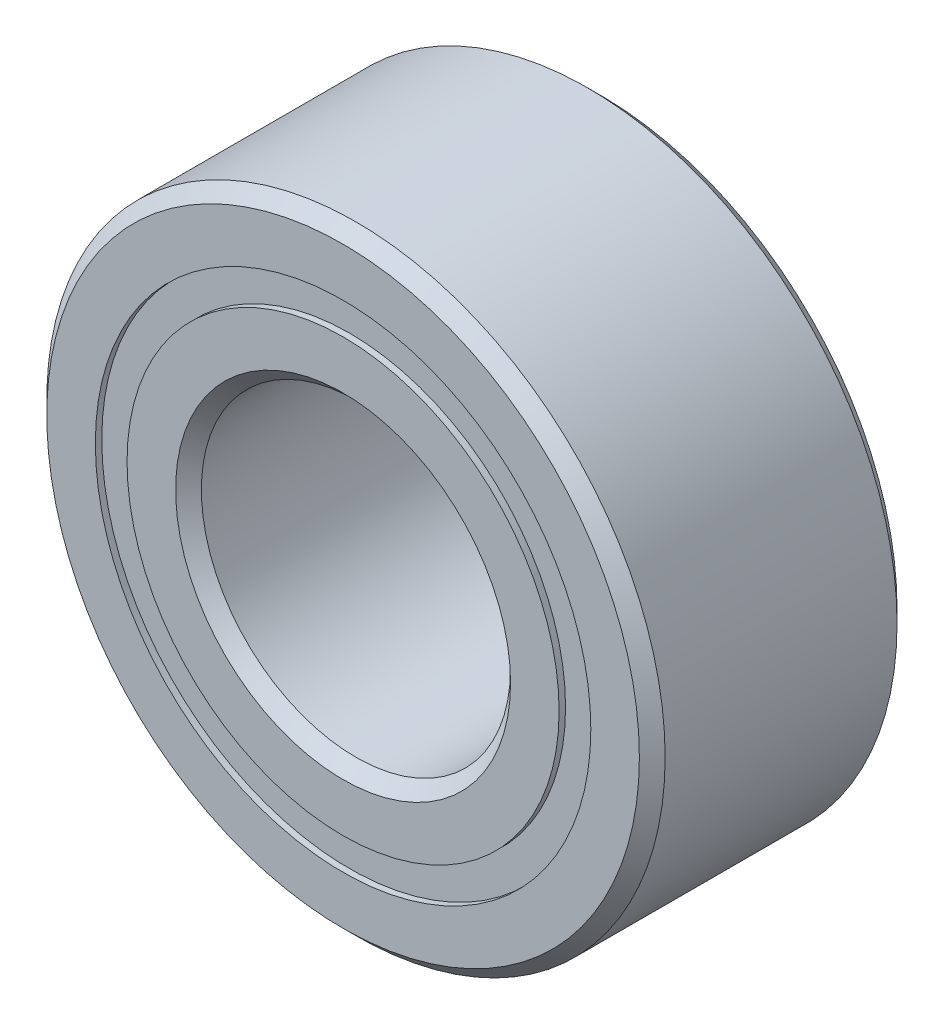
ISO-10303-21;
HEADER;
FILE_DESCRIPTION(('STEP AP214'),'2;1');
FILE_NAME('part.step','',(''),(''),'','','');
FILE_SCHEMA(('AUTOMOTIVE_DESIGN { 1 0 10303 214 1 1 1 1 }'));
ENDSEC;
DATA;
#1=APPLICATION_CONTEXT('core data for automotive mechanical design processes');
#2=APPLICATION_PROTOCOL_DEFINITION('international standard','automotive_design',2000,#1);
#3=PRODUCT_CONTEXT('',#1,'mechanical');
#4=PRODUCT('Part','Part','',(#3));
#5=PRODUCT_RELATED_PRODUCT_CATEGORY('part','',(#4));
#6=PRODUCT_DEFINITION_FORMATION('','',#4);
#7=PRODUCT_DEFINITION_CONTEXT('part definition',#1,'design');
#8=PRODUCT_DEFINITION('design','',#6,#7);
#9=PRODUCT_DEFINITION_SHAPE('','',#8);
#10=(LENGTH_UNIT() NAMED_UNIT(*) SI_UNIT(.MILLI.,.METRE.));
#11=(NAMED_UNIT(*) PLANE_ANGLE_UNIT() SI_UNIT($,.RADIAN.));
#12=(NAMED_UNIT(*) SI_UNIT($,.STERADIAN.) SOLID_ANGLE_UNIT());
#13=UNCERTAINTY_MEASURE_WITH_UNIT(LENGTH_MEASURE(1.E-05),#10,'distance_accuracy_value','');
#14=(GEOMETRIC_REPRESENTATION_CONTEXT(3) GLOBAL_UNCERTAINTY_ASSIGNED_CONTEXT((#13)) GLOBAL_UNIT_ASSIGNED_CONTEXT((#10,
#11,#12)) REPRESENTATION_CONTEXT('',''));
#15=CARTESIAN_POINT('',(0.,0.,0.));
#16=DIRECTION('',(0.,0.,1.));
#17=DIRECTION('',(1.,0.,0.));
#18=AXIS2_PLACEMENT_3D('',#15,#16,#17);
#19=CARTESIAN_POINT('',(0.,2.40384615384615,-1.1875));
#20=DIRECTION('',(0.,0.,1.));
#21=DIRECTION('',(1.,0.,0.));
#22=AXIS2_PLACEMENT_3D('',#19,#20,#21);
#23=PLANE('',#22);
#24=CARTESIAN_POINT('',(0.,0.,-1.1875));
#25=DIRECTION('',(0.,0.,1.));
#26=DIRECTION('',(1.,0.,0.));
#27=AXIS2_PLACEMENT_3D('',#24,#25,#26);
#28=CIRCLE('',#27,2.40384615384615);
#29=CARTESIAN_POINT('',(2.40384615384615,0.,-1.1875));
#30=VERTEX_POINT('',#29);
#31=EDGE_CURVE('E55',#30,#30,#28,.T.);
#32=ORIENTED_EDGE('',*,*,#31,.F.);
#33=EDGE_LOOP('',(#32));
#34=FACE_BOUND('',#33,.T.);
#35=CARTESIAN_POINT('',(0.,0.,-1.1875));
#36=DIRECTION('',(0.,0.,1.));
#37=DIRECTION('',(1.,0.,0.));
#38=AXIS2_PLACEMENT_3D('',#35,#36,#37);
#39=CIRCLE('',#38,2.09615384615385);
#40=CARTESIAN_POINT('',(2.09615384615385,0.,-1.1875));
#41=VERTEX_POINT('',#40);
#42=EDGE_CURVE('E11',#41,#41,#39,.T.);
#43=ORIENTED_EDGE('',*,*,#42,.T.);
#44=EDGE_LOOP('',(#43));
#45=FACE_BOUND('',#44,.T.);
#46=ADVANCED_FACE('F41',(#34,#45),#23,.F.);
#47=CARTESIAN_POINT('',(0.,0.,1.25));
#48=DIRECTION('',(0.,0.,1.));
#49=DIRECTION('',(1.,0.,0.));
#50=AXIS2_PLACEMENT_3D('',#47,#48,#49);
#51=CYLINDRICAL_SURFACE('',#50,2.09615384615385);
#52=ORIENTED_EDGE('',*,*,#42,.F.);
#53=EDGE_LOOP('',(#52));
#54=FACE_BOUND('',#53,.T.);
#55=CARTESIAN_POINT('',(0.,0.,-0.576463888168111));
#56=DIRECTION('',(0.,0.,1.));
#57=DIRECTION('',(1.,0.,0.));
#58=AXIS2_PLACEMENT_3D('',#55,#56,#57);
#59=CIRCLE('',#58,2.09615384615385);
#60=CARTESIAN_POINT('',(2.09615384615385,0.,-0.576463888168111));
#61=VERTEX_POINT('',#60);
#62=EDGE_CURVE('E47',#61,#61,#59,.T.);
#63=ORIENTED_EDGE('',*,*,#62,.T.);
#64=EDGE_LOOP('',(#63));
#65=FACE_BOUND('',#64,.T.);
#66=ADVANCED_FACE('F64',(#54,#65),#51,.F.);
#67=CARTESIAN_POINT('',(0.,2.40384615384615,-0.576463888168111));
#68=DIRECTION('',(0.,0.,-1.));
#69=DIRECTION('',(-1.,0.,0.));
#70=AXIS2_PLACEMENT_3D('',#67,#68,#69);
#71=PLANE('',#70);
#72=ORIENTED_EDGE('',*,*,#62,.F.);
#73=EDGE_LOOP('',(#72));
#74=FACE_BOUND('',#73,.T.);
#75=CARTESIAN_POINT('',(0.,0.,-0.576463888168111));
#76=DIRECTION('',(0.,0.,1.));
#77=DIRECTION('',(1.,0.,0.));
#78=AXIS2_PLACEMENT_3D('',#75,#76,#77);
#79=CIRCLE('',#78,2.40384615384615);
#80=CARTESIAN_POINT('',(2.40384615384615,0.,-0.576463888168111));
#81=VERTEX_POINT('',#80);
#82=EDGE_CURVE('E51',#81,#81,#79,.T.);
#83=ORIENTED_EDGE('',*,*,#82,.T.);
#84=EDGE_LOOP('',(#83));
#85=FACE_BOUND('',#84,.T.);
#86=ADVANCED_FACE('F68',(#74,#85),#71,.F.);
#87=CARTESIAN_POINT('',(0.,0.,1.25));
#88=DIRECTION('',(0.,0.,1.));
#89=DIRECTION('',(1.,0.,0.));
#90=AXIS2_PLACEMENT_3D('',#87,#88,#89);
#91=CYLINDRICAL_SURFACE('',#90,2.40384615384615);
#92=ORIENTED_EDGE('',*,*,#82,.F.);
#93=EDGE_LOOP('',(#92));
#94=FACE_BOUND('',#93,.T.);
#95=ORIENTED_EDGE('',*,*,#31,.T.);
#96=EDGE_LOOP('',(#95));
#97=FACE_BOUND('',#96,.T.);
#98=ADVANCED_FACE('F61',(#94,#97),#91,.T.);
#99=CLOSED_SHELL('',(#46,#66,#86,#98));
#100=MANIFOLD_SOLID_BREP('B2',#99);
#101=CARTESIAN_POINT('',(0.,2.40384615384615,1.1875));
#102=DIRECTION('',(0.,0.,-1.));
#103=DIRECTION('',(-1.,0.,0.));
#104=AXIS2_PLACEMENT_3D('',#101,#102,#103);
#105=PLANE('',#104);
#106=CARTESIAN_POINT('',(0.,0.,1.1875));
#107=DIRECTION('',(0.,0.,1.));
#108=DIRECTION('',(1.,0.,0.));
#109=AXIS2_PLACEMENT_3D('',#106,#107,#108);
#110=CIRCLE('',#109,2.09615384615385);
#111=CARTESIAN_POINT('',(2.09615384615385,0.,1.1875));
#112=VERTEX_POINT('',#111);
#113=EDGE_CURVE('E40',#112,#112,#110,.T.);
#114=ORIENTED_EDGE('',*,*,#113,.F.);
#115=EDGE_LOOP('',(#114));
#116=FACE_BOUND('',#115,.T.);
#117=CARTESIAN_POINT('',(0.,0.,1.1875));
#118=DIRECTION('',(0.,0.,1.));
#119=DIRECTION('',(1.,0.,0.));
#120=AXIS2_PLACEMENT_3D('',#117,#118,#119);
#121=CIRCLE('',#120,2.40384615384615);
#122=CARTESIAN_POINT('',(2.40384615384615,0.,1.1875));
#123=VERTEX_POINT('',#122);
#124=EDGE_CURVE('E122',#123,#123,#121,.T.);
#125=ORIENTED_EDGE('',*,*,#124,.T.);
#126=EDGE_LOOP('',(#125));
#127=FACE_BOUND('',#126,.T.);
#128=ADVANCED_FACE('F108',(#116,#127),#105,.F.);
#129=CARTESIAN_POINT('',(0.,0.,1.25));
#130=DIRECTION('',(0.,0.,1.));
#131=DIRECTION('',(1.,0.,0.));
#132=AXIS2_PLACEMENT_3D('',#129,#130,#131);
#133=CYLINDRICAL_SURFACE('',#132,2.09615384615385);
#134=CARTESIAN_POINT('',(0.,0.,0.576463888168111));
#135=DIRECTION('',(0.,0.,1.));
#136=DIRECTION('',(1.,0.,0.));
#137=AXIS2_PLACEMENT_3D('',#134,#135,#136);
#138=CIRCLE('',#137,2.09615384615385);
#139=CARTESIAN_POINT('',(2.09615384615385,0.,0.576463888168111));
#140=VERTEX_POINT('',#139);
#141=EDGE_CURVE('E114',#140,#140,#138,.T.);
#142=ORIENTED_EDGE('',*,*,#141,.F.);
#143=EDGE_LOOP('',(#142));
#144=FACE_BOUND('',#143,.T.);
#145=ORIENTED_EDGE('',*,*,#113,.T.);
#146=EDGE_LOOP('',(#145));
#147=FACE_BOUND('',#146,.T.);
#148=ADVANCED_FACE('F137',(#144,#147),#133,.F.);
#149=CARTESIAN_POINT('',(0.,2.40384615384615,0.576463888168111));
#150=DIRECTION('',(0.,0.,1.));
#151=DIRECTION('',(1.,0.,0.));
#152=AXIS2_PLACEMENT_3D('',#149,#150,#151);
#153=PLANE('',#152);
#154=CARTESIAN_POINT('',(0.,0.,0.576463888168111));
#155=DIRECTION('',(0.,0.,1.));
#156=DIRECTION('',(1.,0.,0.));
#157=AXIS2_PLACEMENT_3D('',#154,#155,#156);
#158=CIRCLE('',#157,2.40384615384615);
#159=CARTESIAN_POINT('',(2.40384615384615,0.,0.576463888168111));
#160=VERTEX_POINT('',#159);
#161=EDGE_CURVE('E118',#160,#160,#158,.T.);
#162=ORIENTED_EDGE('',*,*,#161,.F.);
#163=EDGE_LOOP('',(#162));
#164=FACE_BOUND('',#163,.T.);
#165=ORIENTED_EDGE('',*,*,#141,.T.);
#166=EDGE_LOOP('',(#165));
#167=FACE_BOUND('',#166,.T.);
#168=ADVANCED_FACE('F132',(#164,#167),#153,.F.);
#169=CARTESIAN_POINT('',(0.,0.,1.25));
#170=DIRECTION('',(0.,0.,1.));
#171=DIRECTION('',(1.,0.,0.));
#172=AXIS2_PLACEMENT_3D('',#169,#170,#171);
#173=CYLINDRICAL_SURFACE('',#172,2.40384615384615);
#174=ORIENTED_EDGE('',*,*,#124,.F.);
#175=EDGE_LOOP('',(#174));
#176=FACE_BOUND('',#175,.T.);
#177=ORIENTED_EDGE('',*,*,#161,.T.);
#178=EDGE_LOOP('',(#177));
#179=FACE_BOUND('',#178,.T.);
#180=ADVANCED_FACE('F129',(#176,#179),#173,.T.);
#181=CLOSED_SHELL('',(#128,#148,#168,#180));
#182=MANIFOLD_SOLID_BREP('B6',#181);
#183=CARTESIAN_POINT('',(-1.12499999999998,1.948557158515,0.));
#184=DIRECTION('',(0.,0.,1.));
#185=DIRECTION('',(-0.499999999999989,0.866025403784445,0.));
#186=AXIS2_PLACEMENT_3D('',#183,#184,#185);
#187=SPHERICAL_SURFACE('',#186,0.576463888168111);
#188=CARTESIAN_POINT('',(-1.12499999999998,1.948557158515,0.576463888168111));
#189=VERTEX_POINT('',#188);
#190=VERTEX_LOOP('',#189);
#191=FACE_BOUND('',#190,.T.);
#192=ADVANCED_FACE('F175',(#191),#187,.T.);
#193=CLOSED_SHELL('',(#192));
#194=MANIFOLD_SOLID_BREP('B35',#193);
#195=CARTESIAN_POINT('',(-1.94855715851497,1.12500000000002,0.));
#196=DIRECTION('',(0.,0.,1.));
#197=DIRECTION('',(-0.866025403784433,0.50000000000001,0.));
#198=AXIS2_PLACEMENT_3D('',#195,#196,#197);
#199=SPHERICAL_SURFACE('',#198,0.576463888168111);
#200=CARTESIAN_POINT('',(-1.94855715851497,1.12500000000002,0.576463888168111));
#201=VERTEX_POINT('',#200);
#202=VERTEX_LOOP('',#201);
#203=FACE_BOUND('',#202,.T.);
#204=ADVANCED_FACE('F195',(#203),#199,.T.);
#205=CLOSED_SHELL('',(#204));
#206=MANIFOLD_SOLID_BREP('B104',#205);
#207=CARTESIAN_POINT('',(-2.25,0.,0.));
#208=DIRECTION('',(0.,0.,1.));
#209=DIRECTION('',(-1.,0.,0.));
#210=AXIS2_PLACEMENT_3D('',#207,#208,#209);
#211=SPHERICAL_SURFACE('',#210,0.576463888168111);
#212=CARTESIAN_POINT('',(-2.25,0.,0.576463888168111));
#213=VERTEX_POINT('',#212);
#214=VERTEX_LOOP('',#213);
#215=FACE_BOUND('',#214,.T.);
#216=ADVANCED_FACE('F215',(#215),#211,.T.);
#217=CLOSED_SHELL('',(#216));
#218=MANIFOLD_SOLID_BREP('B171',#217);
#219=CARTESIAN_POINT('',(-1.948557158515,-1.12499999999998,0.));
#220=DIRECTION('',(0.,0.,1.));
#221=DIRECTION('',(-0.866025403784443,-0.499999999999992,0.));
#222=AXIS2_PLACEMENT_3D('',#219,#220,#221);
#223=SPHERICAL_SURFACE('',#222,0.576463888168111);
#224=CARTESIAN_POINT('',(-1.948557158515,-1.12499999999998,0.576463888168111));
#225=VERTEX_POINT('',#224);
#226=VERTEX_LOOP('',#225);
#227=FACE_BOUND('',#226,.T.);
#228=ADVANCED_FACE('F235',(#227),#223,.T.);
#229=CLOSED_SHELL('',(#228));
#230=MANIFOLD_SOLID_BREP('B191',#229);
#231=CARTESIAN_POINT('',(-1.12500000000002,-1.94855715851498,0.));
#232=DIRECTION('',(0.,0.,1.));
#233=DIRECTION('',(-0.500000000000007,-0.866025403784435,0.));
#234=AXIS2_PLACEMENT_3D('',#231,#232,#233);
#235=SPHERICAL_SURFACE('',#234,0.576463888168111);
#236=CARTESIAN_POINT('',(-1.12500000000002,-1.94855715851498,0.576463888168111));
#237=VERTEX_POINT('',#236);
#238=VERTEX_LOOP('',#237);
#239=FACE_BOUND('',#238,.T.);
#240=ADVANCED_FACE('F255',(#239),#235,.T.);
#241=CLOSED_SHELL('',(#240));
#242=MANIFOLD_SOLID_BREP('B211',#241);
#243=CARTESIAN_POINT('',(0.,-2.25,0.));
#244=DIRECTION('',(0.,0.,1.));
#245=DIRECTION('',(0.,-1.,0.));
#246=AXIS2_PLACEMENT_3D('',#243,#244,#245);
#247=SPHERICAL_SURFACE('',#246,0.576463888168111);
#248=CARTESIAN_POINT('',(0.,-2.25,0.576463888168111));
#249=VERTEX_POINT('',#248);
#250=VERTEX_LOOP('',#249);
#251=FACE_BOUND('',#250,.T.);
#252=ADVANCED_FACE('F275',(#251),#247,.T.);
#253=CLOSED_SHELL('',(#252));
#254=MANIFOLD_SOLID_BREP('B231',#253);
#255=CARTESIAN_POINT('',(1.12499999999999,-1.94855715851499,0.));
#256=DIRECTION('',(0.,0.,1.));
#257=DIRECTION('',(0.499999999999995,-0.866025403784442,0.));
#258=AXIS2_PLACEMENT_3D('',#255,#256,#257);
#259=SPHERICAL_SURFACE('',#258,0.576463888168111);
#260=CARTESIAN_POINT('',(1.12499999999999,-1.94855715851499,0.576463888168111));
#261=VERTEX_POINT('',#260);
#262=VERTEX_LOOP('',#261);
#263=FACE_BOUND('',#262,.T.);
#264=ADVANCED_FACE('F295',(#263),#259,.T.);
#265=CLOSED_SHELL('',(#264));
#266=MANIFOLD_SOLID_BREP('B251',#265);
#267=CARTESIAN_POINT('',(1.94855715851498,-1.12500000000001,0.));
#268=DIRECTION('',(0.,0.,1.));
#269=DIRECTION('',(0.866025403784436,-0.500000000000004,0.));
#270=AXIS2_PLACEMENT_3D('',#267,#268,#269);
#271=SPHERICAL_SURFACE('',#270,0.576463888168111);
#272=CARTESIAN_POINT('',(1.94855715851498,-1.12500000000001,0.576463888168111));
#273=VERTEX_POINT('',#272);
#274=VERTEX_LOOP('',#273);
#275=FACE_BOUND('',#274,.T.);
#276=ADVANCED_FACE('F315',(#275),#271,.T.);
#277=CLOSED_SHELL('',(#276));
#278=MANIFOLD_SOLID_BREP('B271',#277);
#279=CARTESIAN_POINT('',(2.25,0.,0.));
#280=DIRECTION('',(0.,0.,1.));
#281=DIRECTION('',(1.,0.,0.));
#282=AXIS2_PLACEMENT_3D('',#279,#280,#281);
#283=SPHERICAL_SURFACE('',#282,0.576463888168111);
#284=CARTESIAN_POINT('',(2.25,0.,0.576463888168111));
#285=VERTEX_POINT('',#284);
#286=VERTEX_LOOP('',#285);
#287=FACE_BOUND('',#286,.T.);
#288=ADVANCED_FACE('F335',(#287),#283,.T.);
#289=CLOSED_SHELL('',(#288));
#290=MANIFOLD_SOLID_BREP('B291',#289);
#291=CARTESIAN_POINT('',(1.94855715851499,1.125,0.));
#292=DIRECTION('',(0.,0.,1.));
#293=DIRECTION('',(0.86602540378444,0.499999999999998,0.));
#294=AXIS2_PLACEMENT_3D('',#291,#292,#293);
#295=SPHERICAL_SURFACE('',#294,0.576463888168111);
#296=CARTESIAN_POINT('',(1.94855715851499,1.125,0.576463888168111));
#297=VERTEX_POINT('',#296);
#298=VERTEX_LOOP('',#297);
#299=FACE_BOUND('',#298,.T.);
#300=ADVANCED_FACE('F355',(#299),#295,.T.);
#301=CLOSED_SHELL('',(#300));
#302=MANIFOLD_SOLID_BREP('B311',#301);
#303=CARTESIAN_POINT('',(1.125,1.94855715851499,0.));
#304=DIRECTION('',(0.,0.,1.));
#305=DIRECTION('',(0.500000000000001,0.866025403784438,0.));
#306=AXIS2_PLACEMENT_3D('',#303,#304,#305);
#307=SPHERICAL_SURFACE('',#306,0.576463888168111);
#308=CARTESIAN_POINT('',(1.125,1.94855715851499,0.576463888168111));
#309=VERTEX_POINT('',#308);
#310=VERTEX_LOOP('',#309);
#311=FACE_BOUND('',#310,.T.);
#312=ADVANCED_FACE('F375',(#311),#307,.T.);
#313=CLOSED_SHELL('',(#312));
#314=MANIFOLD_SOLID_BREP('B331',#313);
#315=CARTESIAN_POINT('',(0.,2.25,0.));
#316=DIRECTION('',(0.,0.,1.));
#317=DIRECTION('',(0.,1.,0.));
#318=AXIS2_PLACEMENT_3D('',#315,#316,#317);
#319=SPHERICAL_SURFACE('',#318,0.576463888168111);
#320=CARTESIAN_POINT('',(0.,2.25,0.576463888168111));
#321=VERTEX_POINT('',#320);
#322=VERTEX_LOOP('',#321);
#323=FACE_BOUND('',#322,.T.);
#324=ADVANCED_FACE('F397',(#323),#319,.T.);
#325=CLOSED_SHELL('',(#324));
#326=MANIFOLD_SOLID_BREP('B351',#325);
#327=CARTESIAN_POINT('',(0.,2.09615384615385,1.25));
#328=DIRECTION('',(0.,0.,-1.));
#329=DIRECTION('',(-1.,0.,0.));
#330=AXIS2_PLACEMENT_3D('',#327,#328,#329);
#331=PLANE('',#330);
#332=CARTESIAN_POINT('',(0.,0.,1.25));
#333=DIRECTION('',(0.,0.,1.));
#334=DIRECTION('',(1.,0.,0.));
#335=AXIS2_PLACEMENT_3D('',#332,#333,#334);
#336=CIRCLE('',#335,1.625);
#337=CARTESIAN_POINT('',(1.625,0.,1.25));
#338=VERTEX_POINT('',#337);
#339=EDGE_CURVE('E444',#338,#338,#336,.T.);
#340=ORIENTED_EDGE('',*,*,#339,.F.);
#341=EDGE_LOOP('',(#340));
#342=FACE_BOUND('',#341,.T.);
#343=CARTESIAN_POINT('',(0.,0.,1.25));
#344=DIRECTION('',(0.,0.,1.));
#345=DIRECTION('',(1.,0.,0.));
#346=AXIS2_PLACEMENT_3D('',#343,#344,#345);
#347=CIRCLE('',#346,2.09615384615385);
#348=CARTESIAN_POINT('',(2.09615384615385,0.,1.25));
#349=VERTEX_POINT('',#348);
#350=EDGE_CURVE('E396',#349,#349,#347,.T.);
#351=ORIENTED_EDGE('',*,*,#350,.T.);
#352=EDGE_LOOP('',(#351));
#353=FACE_BOUND('',#352,.T.);
#354=ADVANCED_FACE('F416',(#342,#353),#331,.F.);
#355=CARTESIAN_POINT('',(0.,0.,1.25));
#356=DIRECTION('',(0.,0.,1.));
#357=DIRECTION('',(1.,0.,0.));
#358=AXIS2_PLACEMENT_3D('',#355,#356,#357);
#359=CYLINDRICAL_SURFACE('',#358,2.09615384615385);
#360=ORIENTED_EDGE('',*,*,#350,.F.);
#361=EDGE_LOOP('',(#360));
#362=FACE_BOUND('',#361,.T.);
#363=CARTESIAN_POINT('',(0.,0.,0.555555555555555));
#364=DIRECTION('',(0.,0.,1.));
#365=DIRECTION('',(1.,0.,0.));
#366=AXIS2_PLACEMENT_3D('',#363,#364,#365);
#367=CIRCLE('',#366,2.09615384615385);
#368=CARTESIAN_POINT('',(2.09615384615385,0.,0.555555555555555));
#369=VERTEX_POINT('',#368);
#370=EDGE_CURVE('E422',#369,#369,#367,.T.);
#371=ORIENTED_EDGE('',*,*,#370,.T.);
#372=EDGE_LOOP('',(#371));
#373=FACE_BOUND('',#372,.T.);
#374=ADVANCED_FACE('F451',(#362,#373),#359,.T.);
#375=CARTESIAN_POINT('',(0.,0.,0.));
#376=DIRECTION('',(0.,0.,1.));
#377=DIRECTION('',(1.,0.,0.));
#378=AXIS2_PLACEMENT_3D('',#375,#376,#377);
#379=TOROIDAL_SURFACE('',#378,2.25,0.57646388816811);
#380=ORIENTED_EDGE('',*,*,#370,.F.);
#381=EDGE_LOOP('',(#380));
#382=FACE_BOUND('',#381,.T.);
#383=CARTESIAN_POINT('',(0.,0.,-0.555555555555556));
#384=DIRECTION('',(0.,0.,1.));
#385=DIRECTION('',(1.,0.,0.));
#386=AXIS2_PLACEMENT_3D('',#383,#384,#385);
#387=CIRCLE('',#386,2.09615384615385);
#388=CARTESIAN_POINT('',(2.09615384615385,0.,-0.555555555555556));
#389=VERTEX_POINT('',#388);
#390=EDGE_CURVE('E426',#389,#389,#387,.T.);
#391=ORIENTED_EDGE('',*,*,#390,.T.);
#392=EDGE_LOOP('',(#391));
#393=FACE_BOUND('',#392,.T.);
#394=ADVANCED_FACE('F455',(#382,#393),#379,.F.);
#395=CARTESIAN_POINT('',(0.,0.,1.25));
#396=DIRECTION('',(0.,0.,1.));
#397=DIRECTION('',(1.,0.,0.));
#398=AXIS2_PLACEMENT_3D('',#395,#396,#397);
#399=CYLINDRICAL_SURFACE('',#398,2.09615384615385);
#400=ORIENTED_EDGE('',*,*,#390,.F.);
#401=EDGE_LOOP('',(#400));
#402=FACE_BOUND('',#401,.T.);
#403=CARTESIAN_POINT('',(0.,0.,-1.25));
#404=DIRECTION('',(0.,0.,1.));
#405=DIRECTION('',(1.,0.,0.));
#406=AXIS2_PLACEMENT_3D('',#403,#404,#405);
#407=CIRCLE('',#406,2.09615384615385);
#408=CARTESIAN_POINT('',(2.09615384615385,0.,-1.25));
#409=VERTEX_POINT('',#408);
#410=EDGE_CURVE('E430',#409,#409,#407,.T.);
#411=ORIENTED_EDGE('',*,*,#410,.T.);
#412=EDGE_LOOP('',(#411));
#413=FACE_BOUND('',#412,.T.);
#414=ADVANCED_FACE('F460',(#402,#413),#399,.T.);
#415=CARTESIAN_POINT('',(0.,1.625,-1.25));
#416=DIRECTION('',(0.,0.,1.));
#417=DIRECTION('',(1.,0.,0.));
#418=AXIS2_PLACEMENT_3D('',#415,#416,#417);
#419=PLANE('',#418);
#420=ORIENTED_EDGE('',*,*,#410,.F.);
#421=EDGE_LOOP('',(#420));
#422=FACE_BOUND('',#421,.T.);
#423=CARTESIAN_POINT('',(0.,0.,-1.25));
#424=DIRECTION('',(0.,0.,1.));
#425=DIRECTION('',(1.,0.,0.));
#426=AXIS2_PLACEMENT_3D('',#423,#424,#425);
#427=CIRCLE('',#426,1.625);
#428=CARTESIAN_POINT('',(1.625,0.,-1.25));
#429=VERTEX_POINT('',#428);
#430=EDGE_CURVE('E435',#429,#429,#427,.T.);
#431=ORIENTED_EDGE('',*,*,#430,.T.);
#432=EDGE_LOOP('',(#431));
#433=FACE_BOUND('',#432,.T.);
#434=ADVANCED_FACE('F466',(#422,#433),#419,.F.);
#435=CARTESIAN_POINT('',(0.,0.,-1.125));
#436=DIRECTION('',(0.,0.,-1.));
#437=DIRECTION('',(-1.,0.,0.));
#438=AXIS2_PLACEMENT_3D('',#435,#436,#437);
#439=CONICAL_SURFACE('',#438,1.5,0.785398163397449);
#440=ORIENTED_EDGE('',*,*,#430,.F.);
#441=EDGE_LOOP('',(#440));
#442=FACE_BOUND('',#441,.T.);
#443=CARTESIAN_POINT('',(0.,0.,-1.125));
#444=DIRECTION('',(0.,0.,1.));
#445=DIRECTION('',(1.,0.,0.));
#446=AXIS2_PLACEMENT_3D('',#443,#444,#445);
#447=CIRCLE('',#446,1.5);
#448=CARTESIAN_POINT('',(1.5,0.,-1.125));
#449=VERTEX_POINT('',#448);
#450=EDGE_CURVE('E438',#449,#449,#447,.T.);
#451=ORIENTED_EDGE('',*,*,#450,.T.);
#452=EDGE_LOOP('',(#451));
#453=FACE_BOUND('',#452,.T.);
#454=ADVANCED_FACE('F470',(#442,#453),#439,.F.);
#455=CARTESIAN_POINT('',(0.,0.,1.25));
#456=DIRECTION('',(0.,0.,1.));
#457=DIRECTION('',(1.,0.,0.));
#458=AXIS2_PLACEMENT_3D('',#455,#456,#457);
#459=CYLINDRICAL_SURFACE('',#458,1.5);
#460=ORIENTED_EDGE('',*,*,#450,.F.);
#461=EDGE_LOOP('',(#460));
#462=FACE_BOUND('',#461,.T.);
#463=CARTESIAN_POINT('',(0.,0.,1.125));
#464=DIRECTION('',(0.,0.,1.));
#465=DIRECTION('',(1.,0.,0.));
#466=AXIS2_PLACEMENT_3D('',#463,#464,#465);
#467=CIRCLE('',#466,1.5);
#468=CARTESIAN_POINT('',(1.5,0.,1.125));
#469=VERTEX_POINT('',#468);
#470=EDGE_CURVE('E441',#469,#469,#467,.T.);
#471=ORIENTED_EDGE('',*,*,#470,.T.);
#472=EDGE_LOOP('',(#471));
#473=FACE_BOUND('',#472,.T.);
#474=ADVANCED_FACE('F474',(#462,#473),#459,.F.);
#475=CARTESIAN_POINT('',(0.,0.,1.25));
#476=DIRECTION('',(0.,0.,1.));
#477=DIRECTION('',(1.,0.,0.));
#478=AXIS2_PLACEMENT_3D('',#475,#476,#477);
#479=CONICAL_SURFACE('',#478,1.625,0.785398163397448);
#480=ORIENTED_EDGE('',*,*,#470,.F.);
#481=EDGE_LOOP('',(#480));
#482=FACE_BOUND('',#481,.T.);
#483=ORIENTED_EDGE('',*,*,#339,.T.);
#484=EDGE_LOOP('',(#483));
#485=FACE_BOUND('',#484,.T.);
#486=ADVANCED_FACE('F448',(#482,#485),#479,.F.);
#487=CLOSED_SHELL('',(#354,#374,#394,#414,#434,#454,#474,#486));
#488=MANIFOLD_SOLID_BREP('B371',#487);
#489=CARTESIAN_POINT('',(0.,0.,1.125));
#490=DIRECTION('',(0.,0.,-1.));
#491=DIRECTION('',(-1.,0.,0.));
#492=AXIS2_PLACEMENT_3D('',#489,#490,#491);
#493=CONICAL_SURFACE('',#492,3.,0.785398163397449);
#494=CARTESIAN_POINT('',(0.,0.,1.25));
#495=DIRECTION('',(0.,0.,1.));
#496=DIRECTION('',(1.,0.,0.));
#497=AXIS2_PLACEMENT_3D('',#494,#495,#496);
#498=CIRCLE('',#497,2.875);
#499=CARTESIAN_POINT('',(2.875,0.,1.25));
#500=VERTEX_POINT('',#499);
#501=EDGE_CURVE('E565',#500,#500,#498,.T.);
#502=ORIENTED_EDGE('',*,*,#501,.F.);
#503=EDGE_LOOP('',(#502));
#504=FACE_BOUND('',#503,.T.);
#505=CARTESIAN_POINT('',(0.,0.,1.125));
#506=DIRECTION('',(0.,0.,1.));
#507=DIRECTION('',(1.,0.,0.));
#508=AXIS2_PLACEMENT_3D('',#505,#506,#507);
#509=CIRCLE('',#508,3.);
#510=CARTESIAN_POINT('',(3.,0.,1.125));
#511=VERTEX_POINT('',#510);
#512=EDGE_CURVE('E415',#511,#511,#509,.T.);
#513=ORIENTED_EDGE('',*,*,#512,.T.);
#514=EDGE_LOOP('',(#513));
#515=FACE_BOUND('',#514,.T.);
#516=ADVANCED_FACE('F537',(#504,#515),#493,.T.);
#517=CARTESIAN_POINT('',(0.,0.,1.25));
#518=DIRECTION('',(0.,0.,1.));
#519=DIRECTION('',(1.,0.,0.));
#520=AXIS2_PLACEMENT_3D('',#517,#518,#519);
#521=CYLINDRICAL_SURFACE('',#520,3.);
#522=ORIENTED_EDGE('',*,*,#512,.F.);
#523=EDGE_LOOP('',(#522));
#524=FACE_BOUND('',#523,.T.);
#525=CARTESIAN_POINT('',(0.,0.,-1.125));
#526=DIRECTION('',(0.,0.,1.));
#527=DIRECTION('',(1.,0.,0.));
#528=AXIS2_PLACEMENT_3D('',#525,#526,#527);
#529=CIRCLE('',#528,3.);
#530=CARTESIAN_POINT('',(3.,0.,-1.125));
#531=VERTEX_POINT('',#530);
#532=EDGE_CURVE('E543',#531,#531,#529,.T.);
#533=ORIENTED_EDGE('',*,*,#532,.T.);
#534=EDGE_LOOP('',(#533));
#535=FACE_BOUND('',#534,.T.);
#536=ADVANCED_FACE('F572',(#524,#535),#521,.T.);
#537=CARTESIAN_POINT('',(0.,0.,-1.25));
#538=DIRECTION('',(0.,0.,1.));
#539=DIRECTION('',(1.,0.,0.));
#540=AXIS2_PLACEMENT_3D('',#537,#538,#539);
#541=CONICAL_SURFACE('',#540,2.875,0.78539816339745);
#542=ORIENTED_EDGE('',*,*,#532,.F.);
#543=EDGE_LOOP('',(#542));
#544=FACE_BOUND('',#543,.T.);
#545=CARTESIAN_POINT('',(0.,0.,-1.25));
#546=DIRECTION('',(0.,0.,1.));
#547=DIRECTION('',(1.,0.,0.));
#548=AXIS2_PLACEMENT_3D('',#545,#546,#547);
#549=CIRCLE('',#548,2.875);
#550=CARTESIAN_POINT('',(2.875,0.,-1.25));
#551=VERTEX_POINT('',#550);
#552=EDGE_CURVE('E547',#551,#551,#549,.T.);
#553=ORIENTED_EDGE('',*,*,#552,.T.);
#554=EDGE_LOOP('',(#553));
#555=FACE_BOUND('',#554,.T.);
#556=ADVANCED_FACE('F576',(#544,#555),#541,.T.);
#557=CARTESIAN_POINT('',(0.,2.875,-1.25));
#558=DIRECTION('',(0.,0.,1.));
#559=DIRECTION('',(1.,0.,0.));
#560=AXIS2_PLACEMENT_3D('',#557,#558,#559);
#561=PLANE('',#560);
#562=ORIENTED_EDGE('',*,*,#552,.F.);
#563=EDGE_LOOP('',(#562));
#564=FACE_BOUND('',#563,.T.);
#565=CARTESIAN_POINT('',(0.,0.,-1.25));
#566=DIRECTION('',(0.,0.,1.));
#567=DIRECTION('',(1.,0.,0.));
#568=AXIS2_PLACEMENT_3D('',#565,#566,#567);
#569=CIRCLE('',#568,2.40384615384615);
#570=CARTESIAN_POINT('',(2.40384615384615,0.,-1.25));
#571=VERTEX_POINT('',#570);
#572=EDGE_CURVE('E551',#571,#571,#569,.T.);
#573=ORIENTED_EDGE('',*,*,#572,.T.);
#574=EDGE_LOOP('',(#573));
#575=FACE_BOUND('',#574,.T.);
#576=ADVANCED_FACE('F581',(#564,#575),#561,.F.);
#577=CARTESIAN_POINT('',(0.,0.,1.25));
#578=DIRECTION('',(0.,0.,1.));
#579=DIRECTION('',(1.,0.,0.));
#580=AXIS2_PLACEMENT_3D('',#577,#578,#579);
#581=CYLINDRICAL_SURFACE('',#580,2.40384615384615);
#582=ORIENTED_EDGE('',*,*,#572,.F.);
#583=EDGE_LOOP('',(#582));
#584=FACE_BOUND('',#583,.T.);
#585=CARTESIAN_POINT('',(0.,0.,-0.555555555555556));
#586=DIRECTION('',(0.,0.,1.));
#587=DIRECTION('',(1.,0.,0.));
#588=AXIS2_PLACEMENT_3D('',#585,#586,#587);
#589=CIRCLE('',#588,2.40384615384615);
#590=CARTESIAN_POINT('',(2.40384615384615,0.,-0.555555555555556));
#591=VERTEX_POINT('',#590);
#592=EDGE_CURVE('E556',#591,#591,#589,.T.);
#593=ORIENTED_EDGE('',*,*,#592,.T.);
#594=EDGE_LOOP('',(#593));
#595=FACE_BOUND('',#594,.T.);
#596=ADVANCED_FACE('F587',(#584,#595),#581,.F.);
#597=CARTESIAN_POINT('',(0.,0.,0.));
#598=DIRECTION('',(0.,0.,1.));
#599=DIRECTION('',(1.,0.,0.));
#600=AXIS2_PLACEMENT_3D('',#597,#598,#599);
#601=TOROIDAL_SURFACE('',#600,2.25,0.576463888168111);
#602=ORIENTED_EDGE('',*,*,#592,.F.);
#603=EDGE_LOOP('',(#602));
#604=FACE_BOUND('',#603,.T.);
#605=CARTESIAN_POINT('',(0.,0.,0.555555555555555));
#606=DIRECTION('',(0.,0.,1.));
#607=DIRECTION('',(1.,0.,0.));
#608=AXIS2_PLACEMENT_3D('',#605,#606,#607);
#609=CIRCLE('',#608,2.40384615384615);
#610=CARTESIAN_POINT('',(2.40384615384615,0.,0.555555555555555));
#611=VERTEX_POINT('',#610);
#612=EDGE_CURVE('E559',#611,#611,#609,.T.);
#613=ORIENTED_EDGE('',*,*,#612,.T.);
#614=EDGE_LOOP('',(#613));
#615=FACE_BOUND('',#614,.T.);
#616=ADVANCED_FACE('F591',(#604,#615),#601,.F.);
#617=CARTESIAN_POINT('',(0.,0.,1.25));
#618=DIRECTION('',(0.,0.,1.));
#619=DIRECTION('',(1.,0.,0.));
#620=AXIS2_PLACEMENT_3D('',#617,#618,#619);
#621=CYLINDRICAL_SURFACE('',#620,2.40384615384615);
#622=ORIENTED_EDGE('',*,*,#612,.F.);
#623=EDGE_LOOP('',(#622));
#624=FACE_BOUND('',#623,.T.);
#625=CARTESIAN_POINT('',(0.,0.,1.25));
#626=DIRECTION('',(0.,0.,1.));
#627=DIRECTION('',(1.,0.,0.));
#628=AXIS2_PLACEMENT_3D('',#625,#626,#627);
#629=CIRCLE('',#628,2.40384615384615);
#630=CARTESIAN_POINT('',(2.40384615384615,0.,1.25));
#631=VERTEX_POINT('',#630);
#632=EDGE_CURVE('E562',#631,#631,#629,.T.);
#633=ORIENTED_EDGE('',*,*,#632,.T.);
#634=EDGE_LOOP('',(#633));
#635=FACE_BOUND('',#634,.T.);
#636=ADVANCED_FACE('F595',(#624,#635),#621,.F.);
#637=CARTESIAN_POINT('',(0.,2.875,1.25));
#638=DIRECTION('',(0.,0.,-1.));
#639=DIRECTION('',(-1.,0.,0.));
#640=AXIS2_PLACEMENT_3D('',#637,#638,#639);
#641=PLANE('',#640);
#642=ORIENTED_EDGE('',*,*,#632,.F.);
#643=EDGE_LOOP('',(#642));
#644=FACE_BOUND('',#643,.T.);
#645=ORIENTED_EDGE('',*,*,#501,.T.);
#646=EDGE_LOOP('',(#645));
#647=FACE_BOUND('',#646,.T.);
#648=ADVANCED_FACE('F569',(#644,#647),#641,.F.);
#649=CLOSED_SHELL('',(#516,#536,#556,#576,#596,#616,#636,#648));
#650=MANIFOLD_SOLID_BREP('B391',#649);
#651=ADVANCED_BREP_SHAPE_REPRESENTATION('',(#18,#100,#182,#194,#206,#218,#230,#242,#254,#266,
#278,#290,#302,#314,#326,#488,#650),#14);
#652=SHAPE_DEFINITION_REPRESENTATION(#9,#651);
ENDSEC;
END-ISO-10303-21;
